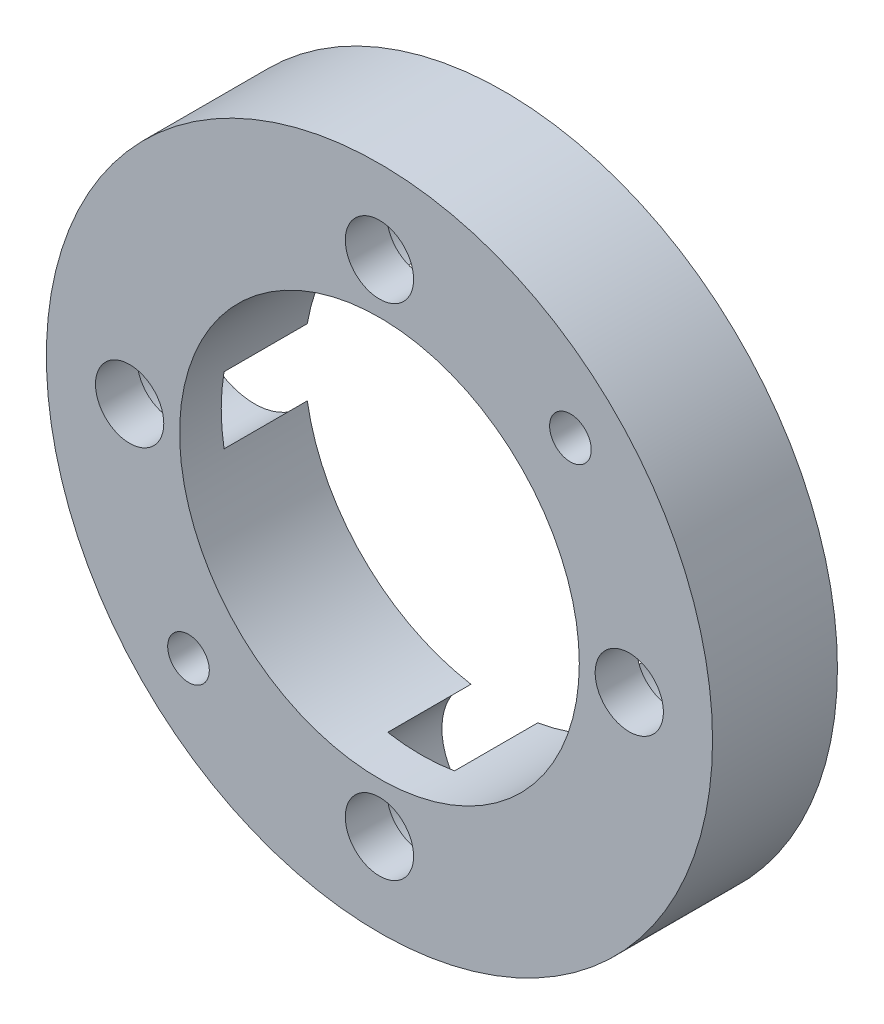
ISO-10303-21;
HEADER;
FILE_DESCRIPTION(('STEP AP214'),'2;1');
FILE_NAME('part.step','',(''),(''),'','','');
FILE_SCHEMA(('AUTOMOTIVE_DESIGN { 1 0 10303 214 1 1 1 1 }'));
ENDSEC;
DATA;
#1=APPLICATION_CONTEXT('core data for automotive mechanical design processes');
#2=APPLICATION_PROTOCOL_DEFINITION('international standard','automotive_design',2000,#1);
#3=PRODUCT_CONTEXT('',#1,'mechanical');
#4=PRODUCT('Part','Part','',(#3));
#5=PRODUCT_RELATED_PRODUCT_CATEGORY('part','',(#4));
#6=PRODUCT_DEFINITION_FORMATION('','',#4);
#7=PRODUCT_DEFINITION_CONTEXT('part definition',#1,'design');
#8=PRODUCT_DEFINITION('design','',#6,#7);
#9=PRODUCT_DEFINITION_SHAPE('','',#8);
#10=(LENGTH_UNIT() NAMED_UNIT(*) SI_UNIT(.MILLI.,.METRE.));
#11=(NAMED_UNIT(*) PLANE_ANGLE_UNIT() SI_UNIT($,.RADIAN.));
#12=(NAMED_UNIT(*) SI_UNIT($,.STERADIAN.) SOLID_ANGLE_UNIT());
#13=UNCERTAINTY_MEASURE_WITH_UNIT(LENGTH_MEASURE(1.E-05),#10,'distance_accuracy_value','');
#14=(GEOMETRIC_REPRESENTATION_CONTEXT(3) GLOBAL_UNCERTAINTY_ASSIGNED_CONTEXT((#13)) GLOBAL_UNIT_ASSIGNED_CONTEXT((#10,
#11,#12)) REPRESENTATION_CONTEXT('',''));
#15=CARTESIAN_POINT('',(0.,0.,0.));
#16=DIRECTION('',(0.,0.,1.));
#17=DIRECTION('',(1.,0.,0.));
#18=AXIS2_PLACEMENT_3D('',#15,#16,#17);
#19=CARTESIAN_POINT('',(0.,15.,7.5));
#20=DIRECTION('',(0.,0.,-1.));
#21=DIRECTION('',(-1.,0.,0.));
#22=AXIS2_PLACEMENT_3D('',#19,#20,#21);
#23=CYLINDRICAL_SURFACE('',#22,2.05);
#24=CARTESIAN_POINT('',(0.,15.,7.5));
#25=DIRECTION('',(0.,0.,1.));
#26=DIRECTION('',(1.,0.,0.));
#27=AXIS2_PLACEMENT_3D('',#24,#25,#26);
#28=CIRCLE('',#27,2.05);
#29=CARTESIAN_POINT('',(2.05,15.,7.5));
#30=VERTEX_POINT('',#29);
#31=EDGE_CURVE('E184',#30,#30,#28,.T.);
#32=ORIENTED_EDGE('',*,*,#31,.T.);
#33=EDGE_LOOP('',(#32));
#34=FACE_BOUND('',#33,.T.);
#35=CARTESIAN_POINT('',(0.,15.,5.));
#36=DIRECTION('',(0.,0.,-1.));
#37=DIRECTION('',(-1.,0.,0.));
#38=AXIS2_PLACEMENT_3D('',#35,#36,#37);
#39=CIRCLE('',#38,2.05);
#40=CARTESIAN_POINT('',(-2.05,15.,5.));
#41=VERTEX_POINT('',#40);
#42=EDGE_CURVE('E155',#41,#41,#39,.T.);
#43=ORIENTED_EDGE('',*,*,#42,.T.);
#44=EDGE_LOOP('',(#43));
#45=FACE_BOUND('',#44,.T.);
#46=ADVANCED_FACE('F39',(#34,#45),#23,.F.);
#47=CARTESIAN_POINT('',(15.0000000000004,4.24488671257339E-13,7.5));
#48=DIRECTION('',(0.,0.,-1.));
#49=DIRECTION('',(-1.,0.,0.));
#50=AXIS2_PLACEMENT_3D('',#47,#48,#49);
#51=CYLINDRICAL_SURFACE('',#50,2.05);
#52=CARTESIAN_POINT('',(15.0000000000004,4.24488671257339E-13,7.5));
#53=DIRECTION('',(0.,0.,1.));
#54=DIRECTION('',(1.,0.,0.));
#55=AXIS2_PLACEMENT_3D('',#52,#53,#54);
#56=CIRCLE('',#55,2.05);
#57=CARTESIAN_POINT('',(17.0500000000004,4.24488671257339E-13,7.5));
#58=VERTEX_POINT('',#57);
#59=EDGE_CURVE('E180',#58,#58,#56,.T.);
#60=ORIENTED_EDGE('',*,*,#59,.T.);
#61=EDGE_LOOP('',(#60));
#62=FACE_BOUND('',#61,.T.);
#63=CARTESIAN_POINT('',(15.0000000000004,4.24488671257339E-13,5.));
#64=DIRECTION('',(0.,0.,-1.));
#65=DIRECTION('',(-1.,0.,0.));
#66=AXIS2_PLACEMENT_3D('',#63,#64,#65);
#67=CIRCLE('',#66,2.05);
#68=CARTESIAN_POINT('',(12.9500000000004,4.24488671257339E-13,5.));
#69=VERTEX_POINT('',#68);
#70=EDGE_CURVE('E229',#69,#69,#67,.T.);
#71=ORIENTED_EDGE('',*,*,#70,.T.);
#72=EDGE_LOOP('',(#71));
#73=FACE_BOUND('',#72,.T.);
#74=ADVANCED_FACE('F288',(#62,#73),#51,.F.);
#75=CARTESIAN_POINT('',(8.48977342514678E-13,-15.,7.5));
#76=DIRECTION('',(0.,0.,-1.));
#77=DIRECTION('',(-1.,0.,0.));
#78=AXIS2_PLACEMENT_3D('',#75,#76,#77);
#79=CYLINDRICAL_SURFACE('',#78,2.05);
#80=CARTESIAN_POINT('',(8.48977342514678E-13,-15.,7.5));
#81=DIRECTION('',(0.,0.,1.));
#82=DIRECTION('',(1.,0.,0.));
#83=AXIS2_PLACEMENT_3D('',#80,#81,#82);
#84=CIRCLE('',#83,2.05);
#85=CARTESIAN_POINT('',(2.05000000000085,-15.,7.5));
#86=VERTEX_POINT('',#85);
#87=EDGE_CURVE('E176',#86,#86,#84,.T.);
#88=ORIENTED_EDGE('',*,*,#87,.T.);
#89=EDGE_LOOP('',(#88));
#90=FACE_BOUND('',#89,.T.);
#91=CARTESIAN_POINT('',(8.48977342514678E-13,-15.,5.));
#92=DIRECTION('',(0.,0.,-1.));
#93=DIRECTION('',(-1.,0.,0.));
#94=AXIS2_PLACEMENT_3D('',#91,#92,#93);
#95=CIRCLE('',#94,2.05);
#96=CARTESIAN_POINT('',(-2.04999999999915,-15.,5.));
#97=VERTEX_POINT('',#96);
#98=EDGE_CURVE('E254',#97,#97,#95,.T.);
#99=ORIENTED_EDGE('',*,*,#98,.T.);
#100=EDGE_LOOP('',(#99));
#101=FACE_BOUND('',#100,.T.);
#102=ADVANCED_FACE('F294',(#90,#101),#79,.F.);
#103=CARTESIAN_POINT('',(-14.9999999999996,-4.2632564145606E-13,7.5));
#104=DIRECTION('',(0.,0.,-1.));
#105=DIRECTION('',(-1.,0.,0.));
#106=AXIS2_PLACEMENT_3D('',#103,#104,#105);
#107=CYLINDRICAL_SURFACE('',#106,2.05);
#108=CARTESIAN_POINT('',(-14.9999999999996,-4.2632564145606E-13,7.5));
#109=DIRECTION('',(0.,0.,1.));
#110=DIRECTION('',(1.,0.,0.));
#111=AXIS2_PLACEMENT_3D('',#108,#109,#110);
#112=CIRCLE('',#111,2.05);
#113=CARTESIAN_POINT('',(-12.9499999999996,-4.2632564145606E-13,7.5));
#114=VERTEX_POINT('',#113);
#115=EDGE_CURVE('E169',#114,#114,#112,.T.);
#116=ORIENTED_EDGE('',*,*,#115,.T.);
#117=EDGE_LOOP('',(#116));
#118=FACE_BOUND('',#117,.T.);
#119=CARTESIAN_POINT('',(-14.9999999999996,-4.2632564145606E-13,5.));
#120=DIRECTION('',(0.,0.,-1.));
#121=DIRECTION('',(-1.,0.,0.));
#122=AXIS2_PLACEMENT_3D('',#119,#120,#121);
#123=CIRCLE('',#122,2.05);
#124=CARTESIAN_POINT('',(-17.0499999999996,-4.2632564145606E-13,5.));
#125=VERTEX_POINT('',#124);
#126=EDGE_CURVE('E159',#125,#125,#123,.T.);
#127=ORIENTED_EDGE('',*,*,#126,.T.);
#128=EDGE_LOOP('',(#127));
#129=FACE_BOUND('',#128,.T.);
#130=ADVANCED_FACE('F262',(#118,#129),#107,.F.);
#131=CARTESIAN_POINT('',(0.,0.,7.5));
#132=DIRECTION('',(0.,0.,1.));
#133=DIRECTION('',(1.,0.,0.));
#134=AXIS2_PLACEMENT_3D('',#131,#132,#133);
#135=PLANE('',#134);
#136=CARTESIAN_POINT('',(-11.4657364569399,-11.4657364569399,7.5));
#137=DIRECTION('',(0.,0.,1.));
#138=DIRECTION('',(1.,0.,0.));
#139=AXIS2_PLACEMENT_3D('',#136,#137,#138);
#140=CIRCLE('',#139,1.25);
#141=CARTESIAN_POINT('',(-10.2157364569399,-11.4657364569399,7.5));
#142=VERTEX_POINT('',#141);
#143=EDGE_CURVE('E137',#142,#142,#140,.T.);
#144=ORIENTED_EDGE('',*,*,#143,.F.);
#145=EDGE_LOOP('',(#144));
#146=FACE_BOUND('',#145,.T.);
#147=CARTESIAN_POINT('',(0.,0.,7.5));
#148=DIRECTION('',(0.,0.,1.));
#149=DIRECTION('',(1.,0.,0.));
#150=AXIS2_PLACEMENT_3D('',#147,#148,#149);
#151=CIRCLE('',#150,12.);
#152=CARTESIAN_POINT('',(12.,0.,7.5));
#153=VERTEX_POINT('',#152);
#154=EDGE_CURVE('E150',#153,#153,#151,.T.);
#155=ORIENTED_EDGE('',*,*,#154,.F.);
#156=EDGE_LOOP('',(#155));
#157=FACE_BOUND('',#156,.T.);
#158=CARTESIAN_POINT('',(11.4657364569399,11.4657364569399,7.5));
#159=DIRECTION('',(0.,0.,1.));
#160=DIRECTION('',(1.,0.,0.));
#161=AXIS2_PLACEMENT_3D('',#158,#159,#160);
#162=CIRCLE('',#161,1.25);
#163=CARTESIAN_POINT('',(12.7157364569399,11.4657364569399,7.5));
#164=VERTEX_POINT('',#163);
#165=EDGE_CURVE('E163',#164,#164,#162,.T.);
#166=ORIENTED_EDGE('',*,*,#165,.F.);
#167=EDGE_LOOP('',(#166));
#168=FACE_BOUND('',#167,.T.);
#169=ORIENTED_EDGE('',*,*,#87,.F.);
#170=EDGE_LOOP('',(#169));
#171=FACE_BOUND('',#170,.T.);
#172=ORIENTED_EDGE('',*,*,#31,.F.);
#173=EDGE_LOOP('',(#172));
#174=FACE_BOUND('',#173,.T.);
#175=CARTESIAN_POINT('',(0.,0.,7.5));
#176=DIRECTION('',(0.,0.,1.));
#177=DIRECTION('',(1.,0.,0.));
#178=AXIS2_PLACEMENT_3D('',#175,#176,#177);
#179=CIRCLE('',#178,20.);
#180=CARTESIAN_POINT('',(20.,0.,7.5));
#181=VERTEX_POINT('',#180);
#182=EDGE_CURVE('E189',#181,#181,#179,.T.);
#183=ORIENTED_EDGE('',*,*,#182,.T.);
#184=EDGE_LOOP('',(#183));
#185=FACE_BOUND('',#184,.T.);
#186=ORIENTED_EDGE('',*,*,#59,.F.);
#187=EDGE_LOOP('',(#186));
#188=FACE_BOUND('',#187,.T.);
#189=ORIENTED_EDGE('',*,*,#115,.F.);
#190=EDGE_LOOP('',(#189));
#191=FACE_BOUND('',#190,.T.);
#192=ADVANCED_FACE('F300',(#146,#157,#168,#171,#174,#185,#188,#191),#135,.T.);
#193=CARTESIAN_POINT('',(0.,0.,0.));
#194=DIRECTION('',(0.,0.,1.));
#195=DIRECTION('',(1.,0.,0.));
#196=AXIS2_PLACEMENT_3D('',#193,#194,#195);
#197=PLANE('',#196);
#198=CARTESIAN_POINT('',(-11.4657364569399,-11.4657364569399,0.));
#199=DIRECTION('',(0.,0.,1.));
#200=DIRECTION('',(1.,0.,0.));
#201=AXIS2_PLACEMENT_3D('',#198,#199,#200);
#202=CIRCLE('',#201,1.25);
#203=CARTESIAN_POINT('',(-10.2157364569399,-11.4657364569399,0.));
#204=VERTEX_POINT('',#203);
#205=EDGE_CURVE('E143',#204,#204,#202,.T.);
#206=ORIENTED_EDGE('',*,*,#205,.T.);
#207=EDGE_LOOP('',(#206));
#208=FACE_BOUND('',#207,.T.);
#209=CARTESIAN_POINT('',(0.,0.,0.));
#210=DIRECTION('',(0.,0.,1.));
#211=DIRECTION('',(1.,0.,0.));
#212=AXIS2_PLACEMENT_3D('',#209,#210,#211);
#213=CIRCLE('',#212,12.);
#214=CARTESIAN_POINT('',(11.8312499999998,2.00537364037349,0.));
#215=VERTEX_POINT('',#214);
#216=CARTESIAN_POINT('',(2.00537364037229,11.83125,0.));
#217=VERTEX_POINT('',#216);
#218=EDGE_CURVE('E125',#215,#217,#213,.T.);
#219=ORIENTED_EDGE('',*,*,#218,.T.);
#220=CARTESIAN_POINT('',(0.,15.,0.));
#221=DIRECTION('',(0.,0.,-1.));
#222=DIRECTION('',(-1.,0.,0.));
#223=AXIS2_PLACEMENT_3D('',#220,#221,#222);
#224=CIRCLE('',#223,3.75);
#225=CARTESIAN_POINT('',(-2.00537364037229,11.83125,0.));
#226=VERTEX_POINT('',#225);
#227=EDGE_CURVE('E230',#226,#217,#224,.T.);
#228=ORIENTED_EDGE('',*,*,#227,.F.);
#229=CARTESIAN_POINT('',(-11.83125,2.00537364037259,0.));
#230=VERTEX_POINT('',#229);
#231=EDGE_CURVE('E138',#226,#230,#213,.T.);
#232=ORIENTED_EDGE('',*,*,#231,.T.);
#233=CARTESIAN_POINT('',(-15.0000000000004,4.24488671257339E-13,0.));
#234=DIRECTION('',(0.,0.,-1.));
#235=DIRECTION('',(-1.,0.,0.));
#236=AXIS2_PLACEMENT_3D('',#233,#234,#235);
#237=CIRCLE('',#236,3.75000000000033);
#238=CARTESIAN_POINT('',(-11.8312500000001,-2.00537364037192,0.));
#239=VERTEX_POINT('',#238);
#240=EDGE_CURVE('E234',#239,#230,#237,.T.);
#241=ORIENTED_EDGE('',*,*,#240,.F.);
#242=CARTESIAN_POINT('',(-2.00537364037431,-11.8312499999997,0.));
#243=VERTEX_POINT('',#242);
#244=EDGE_CURVE('E146',#239,#243,#213,.T.);
#245=ORIENTED_EDGE('',*,*,#244,.T.);
#246=CARTESIAN_POINT('',(-8.48977342514678E-13,-15.,0.));
#247=DIRECTION('',(0.,0.,-1.));
#248=DIRECTION('',(-1.,0.,0.));
#249=AXIS2_PLACEMENT_3D('',#246,#247,#248);
#250=CIRCLE('',#249,3.75000000000091);
#251=CARTESIAN_POINT('',(2.00537364037297,-11.8312499999999,0.));
#252=VERTEX_POINT('',#251);
#253=EDGE_CURVE('E246',#252,#243,#250,.T.);
#254=ORIENTED_EDGE('',*,*,#253,.F.);
#255=CARTESIAN_POINT('',(11.8312499999997,-2.00537364037416,0.));
#256=VERTEX_POINT('',#255);
#257=EDGE_CURVE('E128',#252,#256,#213,.T.);
#258=ORIENTED_EDGE('',*,*,#257,.T.);
#259=CARTESIAN_POINT('',(14.9999999999996,-4.2632564145606E-13,0.));
#260=DIRECTION('',(0.,0.,-1.));
#261=DIRECTION('',(-1.,0.,0.));
#262=AXIS2_PLACEMENT_3D('',#259,#260,#261);
#263=CIRCLE('',#262,3.75000000000068);
#264=EDGE_CURVE('E109',#215,#256,#263,.T.);
#265=ORIENTED_EDGE('',*,*,#264,.F.);
#266=EDGE_LOOP('',(#219,#228,#232,#241,#245,#254,#258,#265));
#267=FACE_BOUND('',#266,.T.);
#268=CARTESIAN_POINT('',(11.4657364569399,11.4657364569399,0.));
#269=DIRECTION('',(0.,0.,1.));
#270=DIRECTION('',(1.,0.,0.));
#271=AXIS2_PLACEMENT_3D('',#268,#269,#270);
#272=CIRCLE('',#271,1.25);
#273=CARTESIAN_POINT('',(12.7157364569399,11.4657364569399,0.));
#274=VERTEX_POINT('',#273);
#275=EDGE_CURVE('E165',#274,#274,#272,.T.);
#276=ORIENTED_EDGE('',*,*,#275,.T.);
#277=EDGE_LOOP('',(#276));
#278=FACE_BOUND('',#277,.T.);
#279=CARTESIAN_POINT('',(0.,0.,0.));
#280=DIRECTION('',(0.,0.,1.));
#281=DIRECTION('',(1.,0.,0.));
#282=AXIS2_PLACEMENT_3D('',#279,#280,#281);
#283=CIRCLE('',#282,20.);
#284=CARTESIAN_POINT('',(20.,0.,0.));
#285=VERTEX_POINT('',#284);
#286=EDGE_CURVE('E188',#285,#285,#283,.T.);
#287=ORIENTED_EDGE('',*,*,#286,.F.);
#288=EDGE_LOOP('',(#287));
#289=FACE_BOUND('',#288,.T.);
#290=ADVANCED_FACE('F122',(#208,#267,#278,#289),#197,.F.);
#291=CARTESIAN_POINT('',(0.,0.,7.5));
#292=DIRECTION('',(0.,0.,-1.));
#293=DIRECTION('',(-1.,0.,0.));
#294=AXIS2_PLACEMENT_3D('',#291,#292,#293);
#295=CYLINDRICAL_SURFACE('',#294,20.);
#296=ORIENTED_EDGE('',*,*,#182,.F.);
#297=EDGE_LOOP('',(#296));
#298=FACE_BOUND('',#297,.T.);
#299=ORIENTED_EDGE('',*,*,#286,.T.);
#300=EDGE_LOOP('',(#299));
#301=FACE_BOUND('',#300,.T.);
#302=ADVANCED_FACE('F41',(#298,#301),#295,.T.);
#303=CARTESIAN_POINT('',(11.4657364569399,11.4657364569399,0.));
#304=DIRECTION('',(0.,0.,1.));
#305=DIRECTION('',(1.,0.,0.));
#306=AXIS2_PLACEMENT_3D('',#303,#304,#305);
#307=CYLINDRICAL_SURFACE('',#306,1.25);
#308=ORIENTED_EDGE('',*,*,#275,.F.);
#309=EDGE_LOOP('',(#308));
#310=FACE_BOUND('',#309,.T.);
#311=ORIENTED_EDGE('',*,*,#165,.T.);
#312=EDGE_LOOP('',(#311));
#313=FACE_BOUND('',#312,.T.);
#314=ADVANCED_FACE('F308',(#310,#313),#307,.F.);
#315=CARTESIAN_POINT('',(0.,0.,0.));
#316=DIRECTION('',(0.,0.,1.));
#317=DIRECTION('',(1.,0.,0.));
#318=AXIS2_PLACEMENT_3D('',#315,#316,#317);
#319=CYLINDRICAL_SURFACE('',#318,12.);
#320=ORIENTED_EDGE('',*,*,#231,.F.);
#321=DIRECTION('',(0.,0.,-1.));
#322=VECTOR('',#321,1.);
#323=CARTESIAN_POINT('',(-2.00537364037229,11.83125,2.5));
#324=LINE('',#323,#322);
#325=CARTESIAN_POINT('',(-2.00537364037229,11.83125,5.));
#326=VERTEX_POINT('',#325);
#327=EDGE_CURVE('E11',#226,#326,#324,.F.);
#328=ORIENTED_EDGE('',*,*,#327,.T.);
#329=CARTESIAN_POINT('',(0.,0.,5.));
#330=DIRECTION('',(0.,0.,-1.));
#331=DIRECTION('',(-1.,0.,0.));
#332=AXIS2_PLACEMENT_3D('',#329,#330,#331);
#333=CIRCLE('',#332,12.);
#334=CARTESIAN_POINT('',(2.00537364037229,11.83125,5.));
#335=VERTEX_POINT('',#334);
#336=EDGE_CURVE('E222',#335,#326,#333,.F.);
#337=ORIENTED_EDGE('',*,*,#336,.F.);
#338=DIRECTION('',(0.,0.,-1.));
#339=VECTOR('',#338,1.);
#340=CARTESIAN_POINT('',(2.00537364037229,11.83125,2.5));
#341=LINE('',#340,#339);
#342=EDGE_CURVE('E48',#335,#217,#341,.T.);
#343=ORIENTED_EDGE('',*,*,#342,.T.);
#344=ORIENTED_EDGE('',*,*,#218,.F.);
#345=DIRECTION('',(0.,0.,-1.));
#346=VECTOR('',#345,1.);
#347=CARTESIAN_POINT('',(11.8312499999998,2.00537364037349,2.5));
#348=LINE('',#347,#346);
#349=CARTESIAN_POINT('',(11.8312499999998,2.00537364037349,5.));
#350=VERTEX_POINT('',#349);
#351=EDGE_CURVE('E105',#215,#350,#348,.F.);
#352=ORIENTED_EDGE('',*,*,#351,.T.);
#353=CARTESIAN_POINT('',(0.,0.,5.));
#354=DIRECTION('',(0.,0.,-1.));
#355=DIRECTION('',(-1.,0.,0.));
#356=AXIS2_PLACEMENT_3D('',#353,#354,#355);
#357=CIRCLE('',#356,12.);
#358=CARTESIAN_POINT('',(11.8312499999997,-2.00537364037416,5.));
#359=VERTEX_POINT('',#358);
#360=EDGE_CURVE('E193',#359,#350,#357,.F.);
#361=ORIENTED_EDGE('',*,*,#360,.F.);
#362=DIRECTION('',(0.,0.,-1.));
#363=VECTOR('',#362,1.);
#364=CARTESIAN_POINT('',(11.8312499999997,-2.00537364037416,2.5));
#365=LINE('',#364,#363);
#366=EDGE_CURVE('E117',#359,#256,#365,.T.);
#367=ORIENTED_EDGE('',*,*,#366,.T.);
#368=ORIENTED_EDGE('',*,*,#257,.F.);
#369=DIRECTION('',(0.,0.,-1.));
#370=VECTOR('',#369,1.);
#371=CARTESIAN_POINT('',(2.00537364037297,-11.8312499999999,2.5));
#372=LINE('',#371,#370);
#373=CARTESIAN_POINT('',(2.00537364037297,-11.8312499999999,5.));
#374=VERTEX_POINT('',#373);
#375=EDGE_CURVE('E207',#252,#374,#372,.F.);
#376=ORIENTED_EDGE('',*,*,#375,.T.);
#377=CARTESIAN_POINT('',(0.,0.,5.));
#378=DIRECTION('',(0.,0.,-1.));
#379=DIRECTION('',(-1.,0.,0.));
#380=AXIS2_PLACEMENT_3D('',#377,#378,#379);
#381=CIRCLE('',#380,12.);
#382=CARTESIAN_POINT('',(-2.00537364037431,-11.8312499999997,5.));
#383=VERTEX_POINT('',#382);
#384=EDGE_CURVE('E116',#383,#374,#381,.F.);
#385=ORIENTED_EDGE('',*,*,#384,.F.);
#386=DIRECTION('',(0.,0.,-1.));
#387=VECTOR('',#386,1.);
#388=CARTESIAN_POINT('',(-2.00537364037431,-11.8312499999997,2.5));
#389=LINE('',#388,#387);
#390=EDGE_CURVE('E203',#383,#243,#389,.T.);
#391=ORIENTED_EDGE('',*,*,#390,.T.);
#392=ORIENTED_EDGE('',*,*,#244,.F.);
#393=DIRECTION('',(0.,0.,-1.));
#394=VECTOR('',#393,1.);
#395=CARTESIAN_POINT('',(-11.8312500000001,-2.00537364037192,2.5));
#396=LINE('',#395,#394);
#397=CARTESIAN_POINT('',(-11.8312500000001,-2.00537364037192,5.));
#398=VERTEX_POINT('',#397);
#399=EDGE_CURVE('E218',#239,#398,#396,.F.);
#400=ORIENTED_EDGE('',*,*,#399,.T.);
#401=CARTESIAN_POINT('',(0.,0.,5.));
#402=DIRECTION('',(0.,0.,-1.));
#403=DIRECTION('',(-1.,0.,0.));
#404=AXIS2_PLACEMENT_3D('',#401,#402,#403);
#405=CIRCLE('',#404,12.);
#406=CARTESIAN_POINT('',(-11.83125,2.00537364037259,5.));
#407=VERTEX_POINT('',#406);
#408=EDGE_CURVE('E211',#407,#398,#405,.F.);
#409=ORIENTED_EDGE('',*,*,#408,.F.);
#410=DIRECTION('',(0.,0.,-1.));
#411=VECTOR('',#410,1.);
#412=CARTESIAN_POINT('',(-11.8312499999999,2.00537364037259,2.5));
#413=LINE('',#412,#411);
#414=EDGE_CURVE('E214',#407,#230,#413,.T.);
#415=ORIENTED_EDGE('',*,*,#414,.T.);
#416=EDGE_LOOP('',(#320,#328,#337,#343,#344,#352,#361,#367,#368,#376,#385,#391,#392,#400,#409,#415));
#417=FACE_BOUND('',#416,.T.);
#418=ORIENTED_EDGE('',*,*,#154,.T.);
#419=EDGE_LOOP('',(#418));
#420=FACE_BOUND('',#419,.T.);
#421=ADVANCED_FACE('F133',(#417,#420),#319,.F.);
#422=CARTESIAN_POINT('',(-11.4657364569399,-11.4657364569399,0.));
#423=DIRECTION('',(0.,0.,1.));
#424=DIRECTION('',(1.,0.,0.));
#425=AXIS2_PLACEMENT_3D('',#422,#423,#424);
#426=CYLINDRICAL_SURFACE('',#425,1.25);
#427=ORIENTED_EDGE('',*,*,#205,.F.);
#428=EDGE_LOOP('',(#427));
#429=FACE_BOUND('',#428,.T.);
#430=ORIENTED_EDGE('',*,*,#143,.T.);
#431=EDGE_LOOP('',(#430));
#432=FACE_BOUND('',#431,.T.);
#433=ADVANCED_FACE('F284',(#429,#432),#426,.F.);
#434=CARTESIAN_POINT('',(14.9999999999996,-4.2632564145606E-13,5.));
#435=DIRECTION('',(0.,0.,-1.));
#436=DIRECTION('',(-1.,0.,0.));
#437=AXIS2_PLACEMENT_3D('',#434,#435,#436);
#438=CYLINDRICAL_SURFACE('',#437,3.75000000000068);
#439=ORIENTED_EDGE('',*,*,#264,.T.);
#440=ORIENTED_EDGE('',*,*,#366,.F.);
#441=CARTESIAN_POINT('',(14.9999999999996,-4.2632564145606E-13,5.));
#442=DIRECTION('',(0.,0.,-1.));
#443=DIRECTION('',(-1.,0.,0.));
#444=AXIS2_PLACEMENT_3D('',#441,#442,#443);
#445=CIRCLE('',#444,3.75000000000068);
#446=EDGE_CURVE('E111',#350,#359,#445,.T.);
#447=ORIENTED_EDGE('',*,*,#446,.F.);
#448=ORIENTED_EDGE('',*,*,#351,.F.);
#449=EDGE_LOOP('',(#439,#440,#447,#448));
#450=FACE_BOUND('',#449,.T.);
#451=ADVANCED_FACE('F107',(#450),#438,.F.);
#452=CARTESIAN_POINT('',(14.9999999999996,-4.2632564145606E-13,5.));
#453=DIRECTION('',(0.,0.,-1.));
#454=DIRECTION('',(-1.,0.,0.));
#455=AXIS2_PLACEMENT_3D('',#452,#453,#454);
#456=PLANE('',#455);
#457=ORIENTED_EDGE('',*,*,#70,.F.);
#458=EDGE_LOOP('',(#457));
#459=FACE_BOUND('',#458,.T.);
#460=ORIENTED_EDGE('',*,*,#360,.T.);
#461=ORIENTED_EDGE('',*,*,#446,.T.);
#462=EDGE_LOOP('',(#460,#461));
#463=FACE_BOUND('',#462,.T.);
#464=ADVANCED_FACE('F273',(#459,#463),#456,.T.);
#465=CARTESIAN_POINT('',(-8.48977342514678E-13,-15.,5.));
#466=DIRECTION('',(0.,0.,-1.));
#467=DIRECTION('',(-1.,0.,0.));
#468=AXIS2_PLACEMENT_3D('',#465,#466,#467);
#469=CYLINDRICAL_SURFACE('',#468,3.75000000000091);
#470=ORIENTED_EDGE('',*,*,#253,.T.);
#471=ORIENTED_EDGE('',*,*,#390,.F.);
#472=CARTESIAN_POINT('',(-8.48977342514678E-13,-15.,5.));
#473=DIRECTION('',(0.,0.,-1.));
#474=DIRECTION('',(-1.,0.,0.));
#475=AXIS2_PLACEMENT_3D('',#472,#473,#474);
#476=CIRCLE('',#475,3.75000000000091);
#477=EDGE_CURVE('E243',#374,#383,#476,.T.);
#478=ORIENTED_EDGE('',*,*,#477,.F.);
#479=ORIENTED_EDGE('',*,*,#375,.F.);
#480=EDGE_LOOP('',(#470,#471,#478,#479));
#481=FACE_BOUND('',#480,.T.);
#482=ADVANCED_FACE('F275',(#481),#469,.F.);
#483=CARTESIAN_POINT('',(-8.48977342514678E-13,-15.,5.));
#484=DIRECTION('',(0.,0.,-1.));
#485=DIRECTION('',(-1.,0.,0.));
#486=AXIS2_PLACEMENT_3D('',#483,#484,#485);
#487=PLANE('',#486);
#488=ORIENTED_EDGE('',*,*,#98,.F.);
#489=EDGE_LOOP('',(#488));
#490=FACE_BOUND('',#489,.T.);
#491=ORIENTED_EDGE('',*,*,#384,.T.);
#492=ORIENTED_EDGE('',*,*,#477,.T.);
#493=EDGE_LOOP('',(#491,#492));
#494=FACE_BOUND('',#493,.T.);
#495=ADVANCED_FACE('F282',(#490,#494),#487,.T.);
#496=CARTESIAN_POINT('',(-15.0000000000004,4.24488671257339E-13,5.));
#497=DIRECTION('',(0.,0.,-1.));
#498=DIRECTION('',(-1.,0.,0.));
#499=AXIS2_PLACEMENT_3D('',#496,#497,#498);
#500=CYLINDRICAL_SURFACE('',#499,3.75000000000033);
#501=ORIENTED_EDGE('',*,*,#240,.T.);
#502=ORIENTED_EDGE('',*,*,#414,.F.);
#503=CARTESIAN_POINT('',(-15.0000000000004,4.24488671257339E-13,5.));
#504=DIRECTION('',(0.,0.,-1.));
#505=DIRECTION('',(-1.,0.,0.));
#506=AXIS2_PLACEMENT_3D('',#503,#504,#505);
#507=CIRCLE('',#506,3.75000000000033);
#508=EDGE_CURVE('E61',#398,#407,#507,.T.);
#509=ORIENTED_EDGE('',*,*,#508,.F.);
#510=ORIENTED_EDGE('',*,*,#399,.F.);
#511=EDGE_LOOP('',(#501,#502,#509,#510));
#512=FACE_BOUND('',#511,.T.);
#513=ADVANCED_FACE('F266',(#512),#500,.F.);
#514=CARTESIAN_POINT('',(-15.0000000000004,4.24488671257339E-13,5.));
#515=DIRECTION('',(0.,0.,-1.));
#516=DIRECTION('',(-1.,0.,0.));
#517=AXIS2_PLACEMENT_3D('',#514,#515,#516);
#518=PLANE('',#517);
#519=ORIENTED_EDGE('',*,*,#126,.F.);
#520=EDGE_LOOP('',(#519));
#521=FACE_BOUND('',#520,.T.);
#522=ORIENTED_EDGE('',*,*,#408,.T.);
#523=ORIENTED_EDGE('',*,*,#508,.T.);
#524=EDGE_LOOP('',(#522,#523));
#525=FACE_BOUND('',#524,.T.);
#526=ADVANCED_FACE('F264',(#521,#525),#518,.T.);
#527=CARTESIAN_POINT('',(0.,15.,5.));
#528=DIRECTION('',(0.,0.,-1.));
#529=DIRECTION('',(-1.,0.,0.));
#530=AXIS2_PLACEMENT_3D('',#527,#528,#529);
#531=CYLINDRICAL_SURFACE('',#530,3.75);
#532=ORIENTED_EDGE('',*,*,#227,.T.);
#533=ORIENTED_EDGE('',*,*,#342,.F.);
#534=CARTESIAN_POINT('',(0.,15.,5.));
#535=DIRECTION('',(0.,0.,-1.));
#536=DIRECTION('',(-1.,0.,0.));
#537=AXIS2_PLACEMENT_3D('',#534,#535,#536);
#538=CIRCLE('',#537,3.75);
#539=EDGE_CURVE('E54',#326,#335,#538,.T.);
#540=ORIENTED_EDGE('',*,*,#539,.F.);
#541=ORIENTED_EDGE('',*,*,#327,.F.);
#542=EDGE_LOOP('',(#532,#533,#540,#541));
#543=FACE_BOUND('',#542,.T.);
#544=ADVANCED_FACE('F227',(#543),#531,.F.);
#545=CARTESIAN_POINT('',(0.,15.,5.));
#546=DIRECTION('',(0.,0.,-1.));
#547=DIRECTION('',(-1.,0.,0.));
#548=AXIS2_PLACEMENT_3D('',#545,#546,#547);
#549=PLANE('',#548);
#550=ORIENTED_EDGE('',*,*,#42,.F.);
#551=EDGE_LOOP('',(#550));
#552=FACE_BOUND('',#551,.T.);
#553=ORIENTED_EDGE('',*,*,#336,.T.);
#554=ORIENTED_EDGE('',*,*,#539,.T.);
#555=EDGE_LOOP('',(#553,#554));
#556=FACE_BOUND('',#555,.T.);
#557=ADVANCED_FACE('F225',(#552,#556),#549,.T.);
#558=CLOSED_SHELL('',(#46,#74,#102,#130,#192,#290,#302,#314,#421,#433,#451,#464,#482,#495,#513,
#526,#544,#557));
#559=MANIFOLD_SOLID_BREP('B2',#558);
#560=ADVANCED_BREP_SHAPE_REPRESENTATION('',(#18,#559),#14);
#561=SHAPE_DEFINITION_REPRESENTATION(#9,#560);
ENDSEC;
END-ISO-10303-21;
